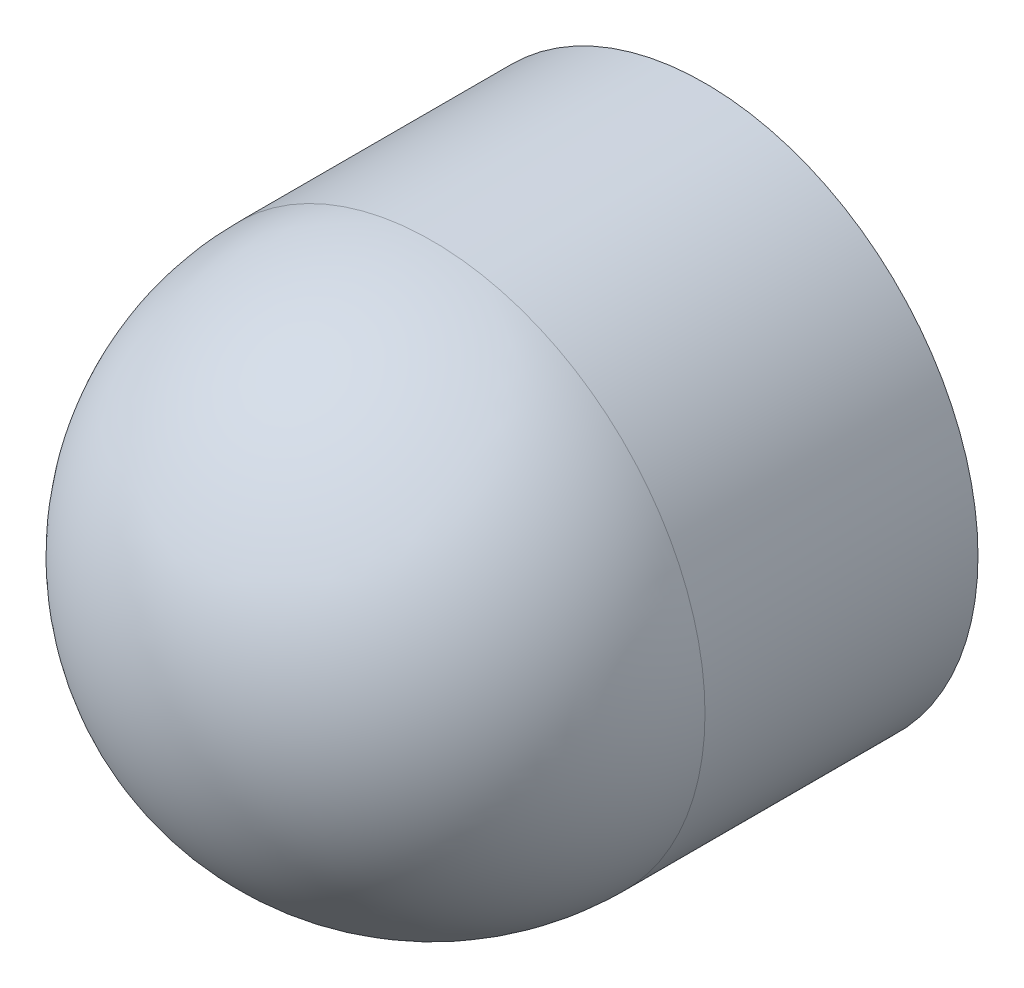
ISO-10303-21;
HEADER;
FILE_DESCRIPTION(('STEP AP214'),'2;1');
FILE_NAME('part.step','',(''),(''),'','','');
FILE_SCHEMA(('AUTOMOTIVE_DESIGN { 1 0 10303 214 1 1 1 1 }'));
ENDSEC;
DATA;
#1=APPLICATION_CONTEXT('core data for automotive mechanical design processes');
#2=APPLICATION_PROTOCOL_DEFINITION('international standard','automotive_design',2000,#1);
#3=PRODUCT_CONTEXT('',#1,'mechanical');
#4=PRODUCT('Part','Part','',(#3));
#5=PRODUCT_RELATED_PRODUCT_CATEGORY('part','',(#4));
#6=PRODUCT_DEFINITION_FORMATION('','',#4);
#7=PRODUCT_DEFINITION_CONTEXT('part definition',#1,'design');
#8=PRODUCT_DEFINITION('design','',#6,#7);
#9=PRODUCT_DEFINITION_SHAPE('','',#8);
#10=(LENGTH_UNIT() NAMED_UNIT(*) SI_UNIT(.MILLI.,.METRE.));
#11=(NAMED_UNIT(*) PLANE_ANGLE_UNIT() SI_UNIT($,.RADIAN.));
#12=(NAMED_UNIT(*) SI_UNIT($,.STERADIAN.) SOLID_ANGLE_UNIT());
#13=UNCERTAINTY_MEASURE_WITH_UNIT(LENGTH_MEASURE(1.E-05),#10,'distance_accuracy_value','');
#14=(GEOMETRIC_REPRESENTATION_CONTEXT(3) GLOBAL_UNCERTAINTY_ASSIGNED_CONTEXT((#13)) GLOBAL_UNIT_ASSIGNED_CONTEXT((#10,
#11,#12)) REPRESENTATION_CONTEXT('',''));
#15=CARTESIAN_POINT('',(0.,0.,0.));
#16=DIRECTION('',(0.,0.,1.));
#17=DIRECTION('',(1.,0.,0.));
#18=AXIS2_PLACEMENT_3D('',#15,#16,#17);
#19=CARTESIAN_POINT('',(-11.684,88.9,7.3025));
#20=DIRECTION('',(1.,0.,0.));
#21=DIRECTION('',(0.,1.,0.));
#22=AXIS2_PLACEMENT_3D('',#19,#20,#21);
#23=SPHERICAL_SURFACE('',#22,5.715);
#24=CARTESIAN_POINT('',(-11.684,88.9,7.3025));
#25=DIRECTION('',(0.,0.,1.));
#26=DIRECTION('',(1.,0.,0.));
#27=AXIS2_PLACEMENT_3D('',#24,#25,#26);
#28=CIRCLE('',#27,5.715);
#29=CARTESIAN_POINT('',(-17.399,88.9,7.3025));
#30=VERTEX_POINT('',#29);
#31=CARTESIAN_POINT('',(-5.969,88.9,7.3025));
#32=VERTEX_POINT('',#31);
#33=EDGE_CURVE('E31',#30,#32,#28,.F.);
#34=ORIENTED_EDGE('',*,*,#33,.F.);
#35=CARTESIAN_POINT('',(-11.684,88.9,7.3025));
#36=DIRECTION('',(0.,0.,1.));
#37=DIRECTION('',(1.,0.,0.));
#38=AXIS2_PLACEMENT_3D('',#35,#36,#37);
#39=CIRCLE('',#38,5.715);
#40=EDGE_CURVE('E25',#32,#30,#39,.F.);
#41=ORIENTED_EDGE('',*,*,#40,.F.);
#42=EDGE_LOOP('',(#34,#41));
#43=FACE_BOUND('',#42,.T.);
#44=ADVANCED_FACE('F17',(#43),#23,.T.);
#45=CARTESIAN_POINT('',(-5.969,88.9,1.5875));
#46=DIRECTION('',(0.,0.,-1.));
#47=DIRECTION('',(-1.,0.,0.));
#48=AXIS2_PLACEMENT_3D('',#45,#46,#47);
#49=PLANE('',#48);
#50=CARTESIAN_POINT('',(-11.684,88.9,1.5875));
#51=DIRECTION('',(0.,0.,1.));
#52=DIRECTION('',(1.,0.,0.));
#53=AXIS2_PLACEMENT_3D('',#50,#51,#52);
#54=CIRCLE('',#53,5.715);
#55=CARTESIAN_POINT('',(-5.969,88.9,1.5875));
#56=VERTEX_POINT('',#55);
#57=EDGE_CURVE('E11',#56,#56,#54,.T.);
#58=ORIENTED_EDGE('',*,*,#57,.F.);
#59=EDGE_LOOP('',(#58));
#60=FACE_BOUND('',#59,.T.);
#61=ADVANCED_FACE('F42',(#60),#49,.T.);
#62=CARTESIAN_POINT('',(-11.684,88.9,4.445));
#63=DIRECTION('',(0.,0.,1.));
#64=DIRECTION('',(1.,0.,0.));
#65=AXIS2_PLACEMENT_3D('',#62,#63,#64);
#66=CYLINDRICAL_SURFACE('',#65,5.715);
#67=ORIENTED_EDGE('',*,*,#57,.T.);
#68=EDGE_LOOP('',(#67));
#69=FACE_BOUND('',#68,.T.);
#70=ORIENTED_EDGE('',*,*,#40,.T.);
#71=ORIENTED_EDGE('',*,*,#33,.T.);
#72=EDGE_LOOP('',(#70,#71));
#73=FACE_BOUND('',#72,.T.);
#74=ADVANCED_FACE('F34',(#69,#73),#66,.T.);
#75=CLOSED_SHELL('',(#44,#61,#74));
#76=MANIFOLD_SOLID_BREP('B1',#75);
#77=ADVANCED_BREP_SHAPE_REPRESENTATION('',(#18,#76),#14);
#78=SHAPE_DEFINITION_REPRESENTATION(#9,#77);
ENDSEC;
END-ISO-10303-21;
